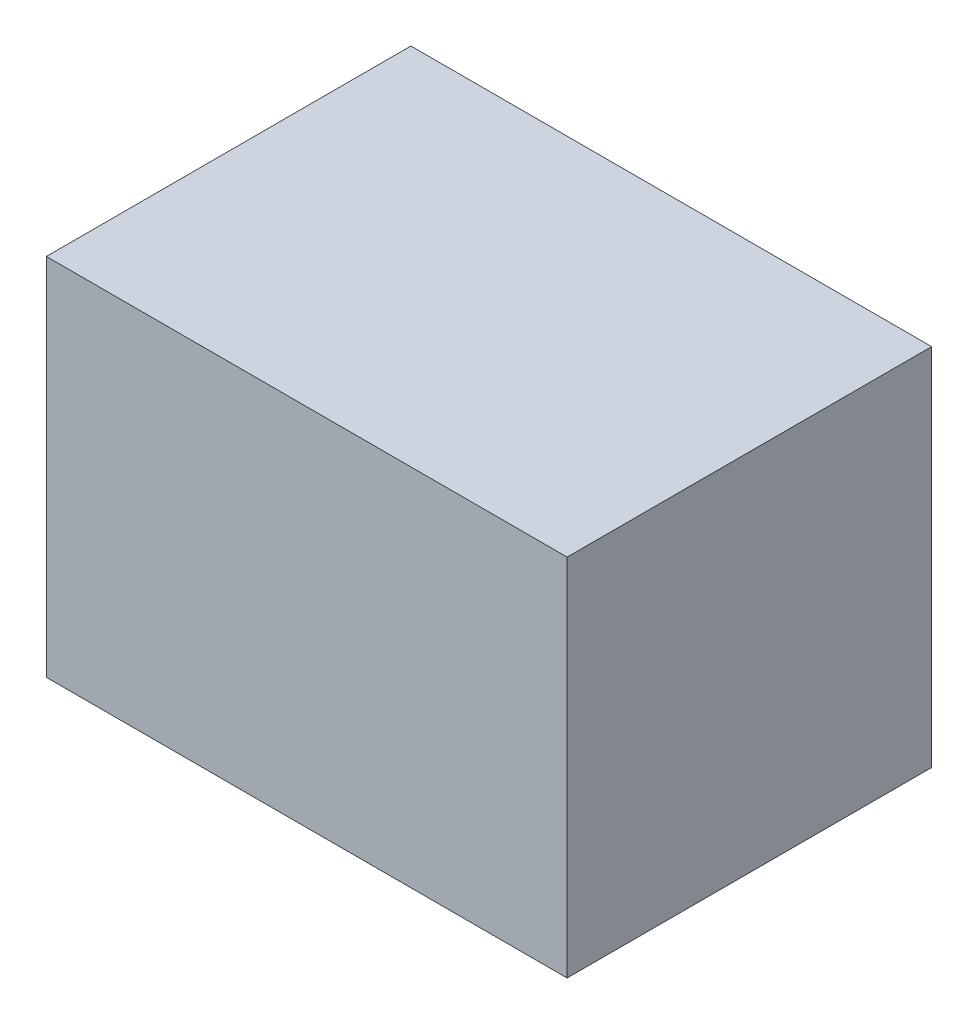
ISO-10303-21;
HEADER;
FILE_DESCRIPTION(('STEP AP214'),'2;1');
FILE_NAME('part.step','',(''),(''),'','','');
FILE_SCHEMA(('AUTOMOTIVE_DESIGN { 1 0 10303 214 1 1 1 1 }'));
ENDSEC;
DATA;
#1=APPLICATION_CONTEXT('core data for automotive mechanical design processes');
#2=APPLICATION_PROTOCOL_DEFINITION('international standard','automotive_design',2000,#1);
#3=PRODUCT_CONTEXT('',#1,'mechanical');
#4=PRODUCT('Part','Part','',(#3));
#5=PRODUCT_RELATED_PRODUCT_CATEGORY('part','',(#4));
#6=PRODUCT_DEFINITION_FORMATION('','',#4);
#7=PRODUCT_DEFINITION_CONTEXT('part definition',#1,'design');
#8=PRODUCT_DEFINITION('design','',#6,#7);
#9=PRODUCT_DEFINITION_SHAPE('','',#8);
#10=(LENGTH_UNIT() NAMED_UNIT(*) SI_UNIT(.MILLI.,.METRE.));
#11=(NAMED_UNIT(*) PLANE_ANGLE_UNIT() SI_UNIT($,.RADIAN.));
#12=(NAMED_UNIT(*) SI_UNIT($,.STERADIAN.) SOLID_ANGLE_UNIT());
#13=UNCERTAINTY_MEASURE_WITH_UNIT(LENGTH_MEASURE(1.E-05),#10,'distance_accuracy_value','');
#14=(GEOMETRIC_REPRESENTATION_CONTEXT(3) GLOBAL_UNCERTAINTY_ASSIGNED_CONTEXT((#13)) GLOBAL_UNIT_ASSIGNED_CONTEXT((#10,
#11,#12)) REPRESENTATION_CONTEXT('',''));
#15=CARTESIAN_POINT('',(0.,0.,0.));
#16=DIRECTION('',(0.,0.,1.));
#17=DIRECTION('',(1.,0.,0.));
#18=AXIS2_PLACEMENT_3D('',#15,#16,#17);
#19=CARTESIAN_POINT('',(-27.94,0.,0.));
#20=DIRECTION('',(0.,-1.,0.));
#21=DIRECTION('',(0.,0.,-1.));
#22=AXIS2_PLACEMENT_3D('',#19,#20,#21);
#23=PLANE('',#22);
#24=DIRECTION('',(1.,0.,0.));
#25=VECTOR('',#24,1.);
#26=CARTESIAN_POINT('',(-27.94,0.,-1.1));
#27=LINE('',#26,#25);
#28=CARTESIAN_POINT('',(-12.95,0.,-1.1));
#29=VERTEX_POINT('',#28);
#30=CARTESIAN_POINT('',(-12.45,0.,-1.1));
#31=VERTEX_POINT('',#30);
#32=EDGE_CURVE('E21',#29,#31,#27,.T.);
#33=ORIENTED_EDGE('',*,*,#32,.F.);
#34=DIRECTION('',(0.,0.,1.));
#35=VECTOR('',#34,1.);
#36=CARTESIAN_POINT('',(-12.95,0.,0.));
#37=LINE('',#36,#35);
#38=CARTESIAN_POINT('',(-12.95,0.,-0.75));
#39=VERTEX_POINT('',#38);
#40=EDGE_CURVE('E28',#29,#39,#37,.T.);
#41=ORIENTED_EDGE('',*,*,#40,.T.);
#42=DIRECTION('',(1.,0.,0.));
#43=VECTOR('',#42,1.);
#44=CARTESIAN_POINT('',(-27.94,0.,-0.75));
#45=LINE('',#44,#43);
#46=CARTESIAN_POINT('',(-12.45,0.,-0.75));
#47=VERTEX_POINT('',#46);
#48=EDGE_CURVE('E69',#39,#47,#45,.T.);
#49=ORIENTED_EDGE('',*,*,#48,.T.);
#50=DIRECTION('',(0.,0.,1.));
#51=VECTOR('',#50,1.);
#52=CARTESIAN_POINT('',(-12.45,0.,0.));
#53=LINE('',#52,#51);
#54=EDGE_CURVE('E89',#31,#47,#53,.T.);
#55=ORIENTED_EDGE('',*,*,#54,.F.);
#56=EDGE_LOOP('',(#33,#41,#49,#55));
#57=FACE_BOUND('',#56,.T.);
#58=ADVANCED_FACE('F17',(#57),#23,.F.);
#59=CARTESIAN_POINT('',(-27.94,-0.35,0.));
#60=DIRECTION('',(0.,-1.,0.));
#61=DIRECTION('',(0.,0.,-1.));
#62=AXIS2_PLACEMENT_3D('',#59,#60,#61);
#63=PLANE('',#62);
#64=DIRECTION('',(1.,0.,0.));
#65=VECTOR('',#64,1.);
#66=CARTESIAN_POINT('',(-27.94,-0.35,-1.1));
#67=LINE('',#66,#65);
#68=CARTESIAN_POINT('',(-12.95,-0.35,-1.1));
#69=VERTEX_POINT('',#68);
#70=CARTESIAN_POINT('',(-12.45,-0.35,-1.1));
#71=VERTEX_POINT('',#70);
#72=EDGE_CURVE('E78',#69,#71,#67,.T.);
#73=ORIENTED_EDGE('',*,*,#72,.T.);
#74=DIRECTION('',(0.,0.,1.));
#75=VECTOR('',#74,1.);
#76=CARTESIAN_POINT('',(-12.45,-0.35,0.));
#77=LINE('',#76,#75);
#78=CARTESIAN_POINT('',(-12.45,-0.35,-0.75));
#79=VERTEX_POINT('',#78);
#80=EDGE_CURVE('E111',#71,#79,#77,.T.);
#81=ORIENTED_EDGE('',*,*,#80,.T.);
#82=DIRECTION('',(1.,0.,0.));
#83=VECTOR('',#82,1.);
#84=CARTESIAN_POINT('',(-27.94,-0.35,-0.75));
#85=LINE('',#84,#83);
#86=CARTESIAN_POINT('',(-12.95,-0.35,-0.75));
#87=VERTEX_POINT('',#86);
#88=EDGE_CURVE('E80',#87,#79,#85,.T.);
#89=ORIENTED_EDGE('',*,*,#88,.F.);
#90=DIRECTION('',(0.,0.,1.));
#91=VECTOR('',#90,1.);
#92=CARTESIAN_POINT('',(-12.95,-0.35,0.));
#93=LINE('',#92,#91);
#94=EDGE_CURVE('E11',#69,#87,#93,.T.);
#95=ORIENTED_EDGE('',*,*,#94,.F.);
#96=EDGE_LOOP('',(#73,#81,#89,#95));
#97=FACE_BOUND('',#96,.T.);
#98=ADVANCED_FACE('F19',(#97),#63,.T.);
#99=CARTESIAN_POINT('',(-12.95,-0.35,0.));
#100=DIRECTION('',(-1.,0.,0.));
#101=DIRECTION('',(0.,0.,1.));
#102=AXIS2_PLACEMENT_3D('',#99,#100,#101);
#103=PLANE('',#102);
#104=ORIENTED_EDGE('',*,*,#40,.F.);
#105=DIRECTION('',(0.,1.,0.));
#106=VECTOR('',#105,1.);
#107=CARTESIAN_POINT('',(-12.95,-0.35,-1.1));
#108=LINE('',#107,#106);
#109=EDGE_CURVE('E83',#69,#29,#108,.T.);
#110=ORIENTED_EDGE('',*,*,#109,.F.);
#111=ORIENTED_EDGE('',*,*,#94,.T.);
#112=DIRECTION('',(0.,1.,0.));
#113=VECTOR('',#112,1.);
#114=CARTESIAN_POINT('',(-12.95,-0.35,-0.75));
#115=LINE('',#114,#113);
#116=EDGE_CURVE('E105',#87,#39,#115,.T.);
#117=ORIENTED_EDGE('',*,*,#116,.T.);
#118=EDGE_LOOP('',(#104,#110,#111,#117));
#119=FACE_BOUND('',#118,.T.);
#120=ADVANCED_FACE('F84',(#119),#103,.T.);
#121=CARTESIAN_POINT('',(-27.94,-0.35,-0.75));
#122=DIRECTION('',(0.,0.,1.));
#123=DIRECTION('',(1.,0.,0.));
#124=AXIS2_PLACEMENT_3D('',#121,#122,#123);
#125=PLANE('',#124);
#126=ORIENTED_EDGE('',*,*,#48,.F.);
#127=ORIENTED_EDGE('',*,*,#116,.F.);
#128=ORIENTED_EDGE('',*,*,#88,.T.);
#129=DIRECTION('',(0.,1.,0.));
#130=VECTOR('',#129,1.);
#131=CARTESIAN_POINT('',(-12.45,-0.35,-0.75));
#132=LINE('',#131,#130);
#133=EDGE_CURVE('E109',#79,#47,#132,.T.);
#134=ORIENTED_EDGE('',*,*,#133,.T.);
#135=EDGE_LOOP('',(#126,#127,#128,#134));
#136=FACE_BOUND('',#135,.T.);
#137=ADVANCED_FACE('F132',(#136),#125,.T.);
#138=CARTESIAN_POINT('',(-12.45,-0.35,0.));
#139=DIRECTION('',(-1.,0.,0.));
#140=DIRECTION('',(0.,0.,1.));
#141=AXIS2_PLACEMENT_3D('',#138,#139,#140);
#142=PLANE('',#141);
#143=ORIENTED_EDGE('',*,*,#54,.T.);
#144=ORIENTED_EDGE('',*,*,#133,.F.);
#145=ORIENTED_EDGE('',*,*,#80,.F.);
#146=DIRECTION('',(0.,1.,0.));
#147=VECTOR('',#146,1.);
#148=CARTESIAN_POINT('',(-12.45,-0.35,-1.1));
#149=LINE('',#148,#147);
#150=EDGE_CURVE('E93',#71,#31,#149,.T.);
#151=ORIENTED_EDGE('',*,*,#150,.T.);
#152=EDGE_LOOP('',(#143,#144,#145,#151));
#153=FACE_BOUND('',#152,.T.);
#154=ADVANCED_FACE('F146',(#153),#142,.F.);
#155=CARTESIAN_POINT('',(-27.94,-0.35,-1.1));
#156=DIRECTION('',(0.,0.,1.));
#157=DIRECTION('',(1.,0.,0.));
#158=AXIS2_PLACEMENT_3D('',#155,#156,#157);
#159=PLANE('',#158);
#160=ORIENTED_EDGE('',*,*,#32,.T.);
#161=ORIENTED_EDGE('',*,*,#150,.F.);
#162=ORIENTED_EDGE('',*,*,#72,.F.);
#163=ORIENTED_EDGE('',*,*,#109,.T.);
#164=EDGE_LOOP('',(#160,#161,#162,#163));
#165=FACE_BOUND('',#164,.T.);
#166=ADVANCED_FACE('F91',(#165),#159,.F.);
#167=CLOSED_SHELL('',(#58,#98,#120,#137,#154,#166));
#168=MANIFOLD_SOLID_BREP('B1',#167);
#169=ADVANCED_BREP_SHAPE_REPRESENTATION('',(#18,#168),#14);
#170=SHAPE_DEFINITION_REPRESENTATION(#9,#169);
ENDSEC;
END-ISO-10303-21;
